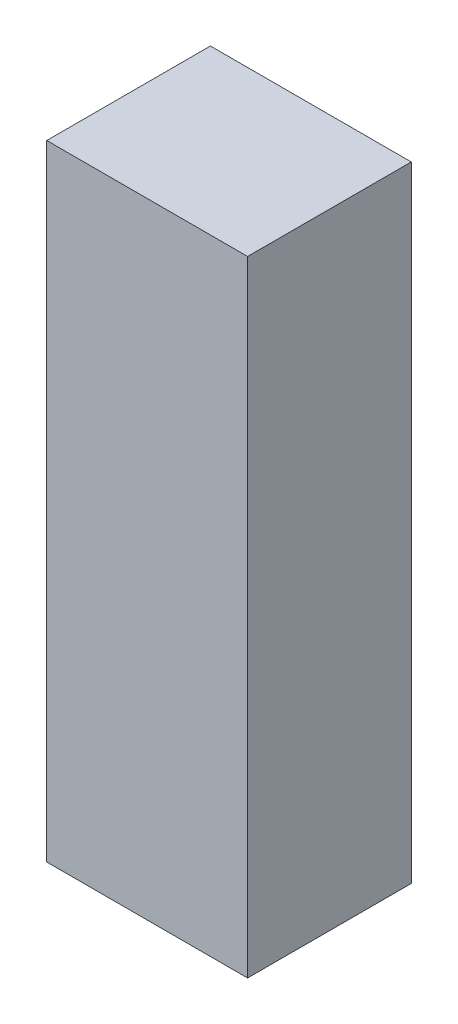
ISO-10303-21;
HEADER;
FILE_DESCRIPTION(('STEP AP214'),'2;1');
FILE_NAME('part.step','',(''),(''),'','','');
FILE_SCHEMA(('AUTOMOTIVE_DESIGN { 1 0 10303 214 1 1 1 1 }'));
ENDSEC;
DATA;
#1=APPLICATION_CONTEXT('core data for automotive mechanical design processes');
#2=APPLICATION_PROTOCOL_DEFINITION('international standard','automotive_design',2000,#1);
#3=PRODUCT_CONTEXT('',#1,'mechanical');
#4=PRODUCT('Part','Part','',(#3));
#5=PRODUCT_RELATED_PRODUCT_CATEGORY('part','',(#4));
#6=PRODUCT_DEFINITION_FORMATION('','',#4);
#7=PRODUCT_DEFINITION_CONTEXT('part definition',#1,'design');
#8=PRODUCT_DEFINITION('design','',#6,#7);
#9=PRODUCT_DEFINITION_SHAPE('','',#8);
#10=(LENGTH_UNIT() NAMED_UNIT(*) SI_UNIT(.MILLI.,.METRE.));
#11=(NAMED_UNIT(*) PLANE_ANGLE_UNIT() SI_UNIT($,.RADIAN.));
#12=(NAMED_UNIT(*) SI_UNIT($,.STERADIAN.) SOLID_ANGLE_UNIT());
#13=UNCERTAINTY_MEASURE_WITH_UNIT(LENGTH_MEASURE(1.E-05),#10,'distance_accuracy_value','');
#14=(GEOMETRIC_REPRESENTATION_CONTEXT(3) GLOBAL_UNCERTAINTY_ASSIGNED_CONTEXT((#13)) GLOBAL_UNIT_ASSIGNED_CONTEXT((#10,
#11,#12)) REPRESENTATION_CONTEXT('',''));
#15=CARTESIAN_POINT('',(0.,0.,0.));
#16=DIRECTION('',(0.,0.,1.));
#17=DIRECTION('',(1.,0.,0.));
#18=AXIS2_PLACEMENT_3D('',#15,#16,#17);
#19=CARTESIAN_POINT('',(-342.9,2133.6,-279.4));
#20=DIRECTION('',(0.,0.,1.));
#21=DIRECTION('',(1.,0.,0.));
#22=AXIS2_PLACEMENT_3D('',#19,#20,#21);
#23=PLANE('',#22);
#24=DIRECTION('',(-1.,0.,0.));
#25=VECTOR('',#24,1.);
#26=CARTESIAN_POINT('',(-342.9,0.,-279.4));
#27=LINE('',#26,#25);
#28=CARTESIAN_POINT('',(342.9,0.,-279.4));
#29=VERTEX_POINT('',#28);
#30=CARTESIAN_POINT('',(-342.9,0.,-279.4));
#31=VERTEX_POINT('',#30);
#32=EDGE_CURVE('E157',#29,#31,#27,.T.);
#33=ORIENTED_EDGE('',*,*,#32,.T.);
#34=DIRECTION('',(0.,-1.,0.));
#35=VECTOR('',#34,1.);
#36=CARTESIAN_POINT('',(-342.9,2133.6,-279.4));
#37=LINE('',#36,#35);
#38=CARTESIAN_POINT('',(-342.9,2133.6,-279.4));
#39=VERTEX_POINT('',#38);
#40=EDGE_CURVE('E42',#39,#31,#37,.T.);
#41=ORIENTED_EDGE('',*,*,#40,.F.);
#42=DIRECTION('',(-1.,0.,0.));
#43=VECTOR('',#42,1.);
#44=CARTESIAN_POINT('',(-342.9,2133.6,-279.4));
#45=LINE('',#44,#43);
#46=CARTESIAN_POINT('',(342.9,2133.6,-279.4));
#47=VERTEX_POINT('',#46);
#48=EDGE_CURVE('E86',#47,#39,#45,.T.);
#49=ORIENTED_EDGE('',*,*,#48,.F.);
#50=DIRECTION('',(0.,-1.,0.));
#51=VECTOR('',#50,1.);
#52=CARTESIAN_POINT('',(342.9,2133.6,-279.4));
#53=LINE('',#52,#51);
#54=EDGE_CURVE('E11',#47,#29,#53,.T.);
#55=ORIENTED_EDGE('',*,*,#54,.T.);
#56=EDGE_LOOP('',(#33,#41,#49,#55));
#57=FACE_BOUND('',#56,.T.);
#58=DIRECTION('',(-1.,0.,0.));
#59=VECTOR('',#58,1.);
#60=CARTESIAN_POINT('',(0.,3.175,-279.4));
#61=LINE('',#60,#59);
#62=CARTESIAN_POINT('',(339.725,3.175,-279.4));
#63=VERTEX_POINT('',#62);
#64=CARTESIAN_POINT('',(-339.725,3.175,-279.4));
#65=VERTEX_POINT('',#64);
#66=EDGE_CURVE('E130',#63,#65,#61,.T.);
#67=ORIENTED_EDGE('',*,*,#66,.F.);
#68=DIRECTION('',(0.,-1.,0.));
#69=VECTOR('',#68,1.);
#70=CARTESIAN_POINT('',(339.725,2133.6,-279.4));
#71=LINE('',#70,#69);
#72=CARTESIAN_POINT('',(339.725,2130.425,-279.4));
#73=VERTEX_POINT('',#72);
#74=EDGE_CURVE('E129',#73,#63,#71,.T.);
#75=ORIENTED_EDGE('',*,*,#74,.F.);
#76=DIRECTION('',(-1.,0.,0.));
#77=VECTOR('',#76,1.);
#78=CARTESIAN_POINT('',(0.,2130.425,-279.4));
#79=LINE('',#78,#77);
#80=CARTESIAN_POINT('',(-339.725,2130.425,-279.4));
#81=VERTEX_POINT('',#80);
#82=EDGE_CURVE('E134',#73,#81,#79,.T.);
#83=ORIENTED_EDGE('',*,*,#82,.T.);
#84=DIRECTION('',(0.,-1.,0.));
#85=VECTOR('',#84,1.);
#86=CARTESIAN_POINT('',(-339.725,2133.6,-279.4));
#87=LINE('',#86,#85);
#88=EDGE_CURVE('E139',#81,#65,#87,.T.);
#89=ORIENTED_EDGE('',*,*,#88,.T.);
#90=EDGE_LOOP('',(#67,#75,#83,#89));
#91=FACE_BOUND('',#90,.T.);
#92=ADVANCED_FACE('F34',(#57,#91),#23,.F.);
#93=CARTESIAN_POINT('',(342.9,2133.6,279.4));
#94=DIRECTION('',(-1.,0.,0.));
#95=DIRECTION('',(0.,0.,1.));
#96=AXIS2_PLACEMENT_3D('',#93,#94,#95);
#97=PLANE('',#96);
#98=DIRECTION('',(0.,0.,-1.));
#99=VECTOR('',#98,1.);
#100=CARTESIAN_POINT('',(342.9,0.,279.4));
#101=LINE('',#100,#99);
#102=CARTESIAN_POINT('',(342.9,0.,279.4));
#103=VERTEX_POINT('',#102);
#104=EDGE_CURVE('E142',#103,#29,#101,.T.);
#105=ORIENTED_EDGE('',*,*,#104,.T.);
#106=ORIENTED_EDGE('',*,*,#54,.F.);
#107=DIRECTION('',(0.,0.,-1.));
#108=VECTOR('',#107,1.);
#109=CARTESIAN_POINT('',(342.9,2133.6,279.4));
#110=LINE('',#109,#108);
#111=CARTESIAN_POINT('',(342.9,2133.6,279.4));
#112=VERTEX_POINT('',#111);
#113=EDGE_CURVE('E148',#112,#47,#110,.T.);
#114=ORIENTED_EDGE('',*,*,#113,.F.);
#115=DIRECTION('',(0.,-1.,0.));
#116=VECTOR('',#115,1.);
#117=CARTESIAN_POINT('',(342.9,2133.6,279.4));
#118=LINE('',#117,#116);
#119=EDGE_CURVE('E154',#112,#103,#118,.T.);
#120=ORIENTED_EDGE('',*,*,#119,.T.);
#121=EDGE_LOOP('',(#105,#106,#114,#120));
#122=FACE_BOUND('',#121,.T.);
#123=ADVANCED_FACE('F36',(#122),#97,.F.);
#124=CARTESIAN_POINT('',(-342.9,2133.6,279.4));
#125=DIRECTION('',(1.,0.,0.));
#126=DIRECTION('',(0.,0.,-1.));
#127=AXIS2_PLACEMENT_3D('',#124,#125,#126);
#128=PLANE('',#127);
#129=DIRECTION('',(0.,0.,1.));
#130=VECTOR('',#129,1.);
#131=CARTESIAN_POINT('',(-342.9,0.,279.4));
#132=LINE('',#131,#130);
#133=CARTESIAN_POINT('',(-342.9,0.,279.4));
#134=VERTEX_POINT('',#133);
#135=EDGE_CURVE('E159',#31,#134,#132,.T.);
#136=ORIENTED_EDGE('',*,*,#135,.T.);
#137=DIRECTION('',(0.,-1.,0.));
#138=VECTOR('',#137,1.);
#139=CARTESIAN_POINT('',(-342.9,2133.6,279.4));
#140=LINE('',#139,#138);
#141=CARTESIAN_POINT('',(-342.9,2133.6,279.4));
#142=VERTEX_POINT('',#141);
#143=EDGE_CURVE('E163',#142,#134,#140,.T.);
#144=ORIENTED_EDGE('',*,*,#143,.F.);
#145=DIRECTION('',(0.,0.,1.));
#146=VECTOR('',#145,1.);
#147=CARTESIAN_POINT('',(-342.9,2133.6,279.4));
#148=LINE('',#147,#146);
#149=EDGE_CURVE('E151',#39,#142,#148,.T.);
#150=ORIENTED_EDGE('',*,*,#149,.F.);
#151=ORIENTED_EDGE('',*,*,#40,.T.);
#152=EDGE_LOOP('',(#136,#144,#150,#151));
#153=FACE_BOUND('',#152,.T.);
#154=ADVANCED_FACE('F168',(#153),#128,.F.);
#155=CARTESIAN_POINT('',(-342.9,2133.6,279.4));
#156=DIRECTION('',(0.,0.,-1.));
#157=DIRECTION('',(-1.,0.,0.));
#158=AXIS2_PLACEMENT_3D('',#155,#156,#157);
#159=PLANE('',#158);
#160=DIRECTION('',(1.,0.,0.));
#161=VECTOR('',#160,1.);
#162=CARTESIAN_POINT('',(-342.9,0.,279.4));
#163=LINE('',#162,#161);
#164=EDGE_CURVE('E79',#134,#103,#163,.T.);
#165=ORIENTED_EDGE('',*,*,#164,.T.);
#166=ORIENTED_EDGE('',*,*,#119,.F.);
#167=DIRECTION('',(1.,0.,0.));
#168=VECTOR('',#167,1.);
#169=CARTESIAN_POINT('',(-342.9,2133.6,279.4));
#170=LINE('',#169,#168);
#171=EDGE_CURVE('E58',#142,#112,#170,.T.);
#172=ORIENTED_EDGE('',*,*,#171,.F.);
#173=ORIENTED_EDGE('',*,*,#143,.T.);
#174=EDGE_LOOP('',(#165,#166,#172,#173));
#175=FACE_BOUND('',#174,.T.);
#176=ADVANCED_FACE('F176',(#175),#159,.F.);
#177=CARTESIAN_POINT('',(0.,2133.6,0.));
#178=DIRECTION('',(0.,-1.,0.));
#179=DIRECTION('',(0.,0.,-1.));
#180=AXIS2_PLACEMENT_3D('',#177,#178,#179);
#181=PLANE('',#180);
#182=ORIENTED_EDGE('',*,*,#113,.T.);
#183=ORIENTED_EDGE('',*,*,#48,.T.);
#184=ORIENTED_EDGE('',*,*,#149,.T.);
#185=ORIENTED_EDGE('',*,*,#171,.T.);
#186=EDGE_LOOP('',(#182,#183,#184,#185));
#187=FACE_BOUND('',#186,.T.);
#188=ADVANCED_FACE('F178',(#187),#181,.F.);
#189=CARTESIAN_POINT('',(0.,0.,0.));
#190=DIRECTION('',(0.,-1.,0.));
#191=DIRECTION('',(0.,0.,-1.));
#192=AXIS2_PLACEMENT_3D('',#189,#190,#191);
#193=PLANE('',#192);
#194=ORIENTED_EDGE('',*,*,#104,.F.);
#195=ORIENTED_EDGE('',*,*,#164,.F.);
#196=ORIENTED_EDGE('',*,*,#135,.F.);
#197=ORIENTED_EDGE('',*,*,#32,.F.);
#198=EDGE_LOOP('',(#194,#195,#196,#197));
#199=FACE_BOUND('',#198,.T.);
#200=ADVANCED_FACE('F172',(#199),#193,.T.);
#201=CARTESIAN_POINT('',(339.725,2133.6,279.4));
#202=DIRECTION('',(-1.,0.,0.));
#203=DIRECTION('',(0.,0.,1.));
#204=AXIS2_PLACEMENT_3D('',#201,#202,#203);
#205=PLANE('',#204);
#206=DIRECTION('',(0.,0.,-1.));
#207=VECTOR('',#206,1.);
#208=CARTESIAN_POINT('',(339.725,3.175,0.));
#209=LINE('',#208,#207);
#210=CARTESIAN_POINT('',(339.725,3.175,276.225));
#211=VERTEX_POINT('',#210);
#212=EDGE_CURVE('E113',#211,#63,#209,.T.);
#213=ORIENTED_EDGE('',*,*,#212,.F.);
#214=DIRECTION('',(0.,-1.,0.));
#215=VECTOR('',#214,1.);
#216=CARTESIAN_POINT('',(339.725,2133.6,276.225));
#217=LINE('',#216,#215);
#218=CARTESIAN_POINT('',(339.725,2130.425,276.225));
#219=VERTEX_POINT('',#218);
#220=EDGE_CURVE('E121',#219,#211,#217,.T.);
#221=ORIENTED_EDGE('',*,*,#220,.F.);
#222=DIRECTION('',(0.,0.,-1.));
#223=VECTOR('',#222,1.);
#224=CARTESIAN_POINT('',(339.725,2130.425,0.));
#225=LINE('',#224,#223);
#226=EDGE_CURVE('E49',#219,#73,#225,.T.);
#227=ORIENTED_EDGE('',*,*,#226,.T.);
#228=ORIENTED_EDGE('',*,*,#74,.T.);
#229=EDGE_LOOP('',(#213,#221,#227,#228));
#230=FACE_BOUND('',#229,.T.);
#231=ADVANCED_FACE('F127',(#230),#205,.T.);
#232=CARTESIAN_POINT('',(-339.725,2133.6,279.4));
#233=DIRECTION('',(1.,0.,0.));
#234=DIRECTION('',(0.,0.,-1.));
#235=AXIS2_PLACEMENT_3D('',#232,#233,#234);
#236=PLANE('',#235);
#237=DIRECTION('',(0.,0.,1.));
#238=VECTOR('',#237,1.);
#239=CARTESIAN_POINT('',(-339.725,3.175,0.));
#240=LINE('',#239,#238);
#241=CARTESIAN_POINT('',(-339.725,3.175,276.225));
#242=VERTEX_POINT('',#241);
#243=EDGE_CURVE('E116',#65,#242,#240,.T.);
#244=ORIENTED_EDGE('',*,*,#243,.F.);
#245=ORIENTED_EDGE('',*,*,#88,.F.);
#246=DIRECTION('',(0.,0.,1.));
#247=VECTOR('',#246,1.);
#248=CARTESIAN_POINT('',(-339.725,2130.425,0.));
#249=LINE('',#248,#247);
#250=CARTESIAN_POINT('',(-339.725,2130.425,276.225));
#251=VERTEX_POINT('',#250);
#252=EDGE_CURVE('E137',#81,#251,#249,.T.);
#253=ORIENTED_EDGE('',*,*,#252,.T.);
#254=DIRECTION('',(0.,-1.,0.));
#255=VECTOR('',#254,1.);
#256=CARTESIAN_POINT('',(-339.725,2133.6,276.225));
#257=LINE('',#256,#255);
#258=EDGE_CURVE('E125',#251,#242,#257,.T.);
#259=ORIENTED_EDGE('',*,*,#258,.T.);
#260=EDGE_LOOP('',(#244,#245,#253,#259));
#261=FACE_BOUND('',#260,.T.);
#262=ADVANCED_FACE('F195',(#261),#236,.T.);
#263=CARTESIAN_POINT('',(-342.9,2133.6,276.225));
#264=DIRECTION('',(0.,0.,-1.));
#265=DIRECTION('',(-1.,0.,0.));
#266=AXIS2_PLACEMENT_3D('',#263,#264,#265);
#267=PLANE('',#266);
#268=DIRECTION('',(1.,0.,0.));
#269=VECTOR('',#268,1.);
#270=CARTESIAN_POINT('',(0.,3.175,276.225));
#271=LINE('',#270,#269);
#272=EDGE_CURVE('E109',#242,#211,#271,.T.);
#273=ORIENTED_EDGE('',*,*,#272,.F.);
#274=ORIENTED_EDGE('',*,*,#258,.F.);
#275=DIRECTION('',(1.,0.,0.));
#276=VECTOR('',#275,1.);
#277=CARTESIAN_POINT('',(0.,2130.425,276.225));
#278=LINE('',#277,#276);
#279=EDGE_CURVE('E124',#251,#219,#278,.T.);
#280=ORIENTED_EDGE('',*,*,#279,.T.);
#281=ORIENTED_EDGE('',*,*,#220,.T.);
#282=EDGE_LOOP('',(#273,#274,#280,#281));
#283=FACE_BOUND('',#282,.T.);
#284=ADVANCED_FACE('F122',(#283),#267,.T.);
#285=CARTESIAN_POINT('',(0.,2130.425,0.));
#286=DIRECTION('',(0.,-1.,0.));
#287=DIRECTION('',(0.,0.,-1.));
#288=AXIS2_PLACEMENT_3D('',#285,#286,#287);
#289=PLANE('',#288);
#290=ORIENTED_EDGE('',*,*,#226,.F.);
#291=ORIENTED_EDGE('',*,*,#279,.F.);
#292=ORIENTED_EDGE('',*,*,#252,.F.);
#293=ORIENTED_EDGE('',*,*,#82,.F.);
#294=EDGE_LOOP('',(#290,#291,#292,#293));
#295=FACE_BOUND('',#294,.T.);
#296=ADVANCED_FACE('F198',(#295),#289,.T.);
#297=CARTESIAN_POINT('',(0.,3.175,0.));
#298=DIRECTION('',(0.,-1.,0.));
#299=DIRECTION('',(0.,0.,-1.));
#300=AXIS2_PLACEMENT_3D('',#297,#298,#299);
#301=PLANE('',#300);
#302=ORIENTED_EDGE('',*,*,#212,.T.);
#303=ORIENTED_EDGE('',*,*,#66,.T.);
#304=ORIENTED_EDGE('',*,*,#243,.T.);
#305=ORIENTED_EDGE('',*,*,#272,.T.);
#306=EDGE_LOOP('',(#302,#303,#304,#305));
#307=FACE_BOUND('',#306,.T.);
#308=ADVANCED_FACE('F111',(#307),#301,.F.);
#309=CLOSED_SHELL('',(#92,#123,#154,#176,#188,#200,#231,#262,#284,#296,#308));
#310=MANIFOLD_SOLID_BREP('B2',#309);
#311=ADVANCED_BREP_SHAPE_REPRESENTATION('',(#18,#310),#14);
#312=SHAPE_DEFINITION_REPRESENTATION(#9,#311);
ENDSEC;
END-ISO-10303-21;
